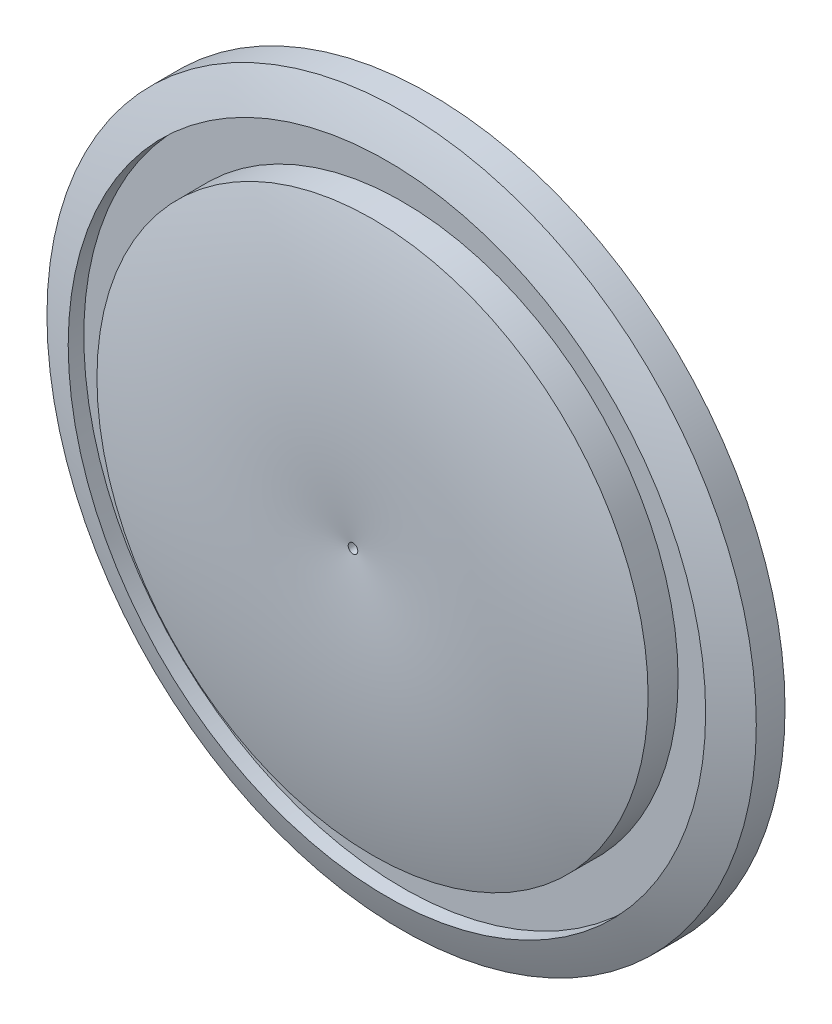
ISO-10303-21;
HEADER;
FILE_DESCRIPTION(('STEP AP214'),'2;1');
FILE_NAME('part.step','',(''),(''),'','','');
FILE_SCHEMA(('AUTOMOTIVE_DESIGN { 1 0 10303 214 1 1 1 1 }'));
ENDSEC;
DATA;
#1=APPLICATION_CONTEXT('core data for automotive mechanical design processes');
#2=APPLICATION_PROTOCOL_DEFINITION('international standard','automotive_design',2000,#1);
#3=PRODUCT_CONTEXT('',#1,'mechanical');
#4=PRODUCT('Part','Part','',(#3));
#5=PRODUCT_RELATED_PRODUCT_CATEGORY('part','',(#4));
#6=PRODUCT_DEFINITION_FORMATION('','',#4);
#7=PRODUCT_DEFINITION_CONTEXT('part definition',#1,'design');
#8=PRODUCT_DEFINITION('design','',#6,#7);
#9=PRODUCT_DEFINITION_SHAPE('','',#8);
#10=(LENGTH_UNIT() NAMED_UNIT(*) SI_UNIT(.MILLI.,.METRE.));
#11=(NAMED_UNIT(*) PLANE_ANGLE_UNIT() SI_UNIT($,.RADIAN.));
#12=(NAMED_UNIT(*) SI_UNIT($,.STERADIAN.) SOLID_ANGLE_UNIT());
#13=UNCERTAINTY_MEASURE_WITH_UNIT(LENGTH_MEASURE(1.E-05),#10,'distance_accuracy_value','');
#14=(GEOMETRIC_REPRESENTATION_CONTEXT(3) GLOBAL_UNCERTAINTY_ASSIGNED_CONTEXT((#13)) GLOBAL_UNIT_ASSIGNED_CONTEXT((#10,
#11,#12)) REPRESENTATION_CONTEXT('',''));
#15=CARTESIAN_POINT('',(0.,0.,0.));
#16=DIRECTION('',(0.,0.,1.));
#17=DIRECTION('',(1.,0.,0.));
#18=AXIS2_PLACEMENT_3D('',#15,#16,#17);
#19=CARTESIAN_POINT('',(0.,0.,-60.236368945266));
#20=DIRECTION('',(0.,0.,-1.));
#21=DIRECTION('',(-1.,0.,0.));
#22=AXIS2_PLACEMENT_3D('',#19,#20,#21);
#23=DEGENERATE_TOROIDAL_SURFACE('',#22,9.94196390232948,66.5759820648709,.T.);
#24=CARTESIAN_POINT('',(0.,0.,5.66667123930457));
#25=DIRECTION('',(0.,0.,-1.));
#26=DIRECTION('',(-1.,0.,0.));
#27=AXIS2_PLACEMENT_3D('',#24,#25,#26);
#28=CIRCLE('',#27,0.5);
#29=CARTESIAN_POINT('',(-0.5,0.,5.66667123930457));
#30=VERTEX_POINT('',#29);
#31=EDGE_CURVE('E44',#30,#30,#28,.F.);
#32=ORIENTED_EDGE('',*,*,#31,.F.);
#33=EDGE_LOOP('',(#32));
#34=FACE_BOUND('',#33,.T.);
#35=CARTESIAN_POINT('',(0.,0.,3.62769893371223));
#36=DIRECTION('',(0.,0.,-1.));
#37=DIRECTION('',(-1.,0.,0.));
#38=AXIS2_PLACEMENT_3D('',#35,#36,#37);
#39=CIRCLE('',#38,28.75);
#40=CARTESIAN_POINT('',(-28.75,0.,3.62769893371223));
#41=VERTEX_POINT('',#40);
#42=EDGE_CURVE('E50',#41,#41,#39,.F.);
#43=ORIENTED_EDGE('',*,*,#42,.T.);
#44=EDGE_LOOP('',(#43));
#45=FACE_BOUND('',#44,.T.);
#46=ADVANCED_FACE('F31',(#34,#45),#23,.T.);
#47=CARTESIAN_POINT('',(0.,0.,-2.40690182250407));
#48=DIRECTION('',(0.,0.,-1.));
#49=DIRECTION('',(-1.,0.,0.));
#50=AXIS2_PLACEMENT_3D('',#47,#48,#49);
#51=PLANE('',#50);
#52=CARTESIAN_POINT('',(0.,0.,-2.40690182250407));
#53=DIRECTION('',(0.,0.,-1.));
#54=DIRECTION('',(-1.,0.,0.));
#55=AXIS2_PLACEMENT_3D('',#52,#53,#54);
#56=CIRCLE('',#55,0.5);
#57=CARTESIAN_POINT('',(-0.5,0.,-2.40690182250407));
#58=VERTEX_POINT('',#57);
#59=EDGE_CURVE('E49',#58,#58,#56,.T.);
#60=ORIENTED_EDGE('',*,*,#59,.F.);
#61=EDGE_LOOP('',(#60));
#62=FACE_BOUND('',#61,.T.);
#63=CARTESIAN_POINT('',(0.,0.,-2.40690182250406));
#64=DIRECTION('',(0.,0.,-1.));
#65=DIRECTION('',(-1.,0.,0.));
#66=AXIS2_PLACEMENT_3D('',#63,#64,#65);
#67=CIRCLE('',#66,37.);
#68=CARTESIAN_POINT('',(-37.,0.,-2.40690182250406));
#69=VERTEX_POINT('',#68);
#70=EDGE_CURVE('E10',#69,#69,#67,.T.);
#71=ORIENTED_EDGE('',*,*,#70,.T.);
#72=EDGE_LOOP('',(#71));
#73=FACE_BOUND('',#72,.T.);
#74=ADVANCED_FACE('F33',(#62,#73),#51,.T.);
#75=CARTESIAN_POINT('',(0.,0.,-18.524642857156));
#76=DIRECTION('',(0.,0.,-1.));
#77=DIRECTION('',(-1.,0.,0.));
#78=AXIS2_PLACEMENT_3D('',#75,#76,#77);
#79=CYLINDRICAL_SURFACE('',#78,37.);
#80=CARTESIAN_POINT('',(0.,0.,0.593098177495935));
#81=DIRECTION('',(0.,0.,-1.));
#82=DIRECTION('',(-1.,0.,0.));
#83=AXIS2_PLACEMENT_3D('',#80,#81,#82);
#84=CIRCLE('',#83,37.);
#85=CARTESIAN_POINT('',(-37.,0.,0.593098177495935));
#86=VERTEX_POINT('',#85);
#87=EDGE_CURVE('E39',#86,#86,#84,.T.);
#88=ORIENTED_EDGE('',*,*,#87,.T.);
#89=EDGE_LOOP('',(#88));
#90=FACE_BOUND('',#89,.T.);
#91=ORIENTED_EDGE('',*,*,#70,.F.);
#92=EDGE_LOOP('',(#91));
#93=FACE_BOUND('',#92,.T.);
#94=ADVANCED_FACE('F69',(#90,#93),#79,.T.);
#95=CARTESIAN_POINT('',(0.,0.,2.12625480623842));
#96=DIRECTION('',(0.,0.,-1.));
#97=DIRECTION('',(-1.,0.,0.));
#98=AXIS2_PLACEMENT_3D('',#95,#96,#97);
#99=CIRCLE('',#98,33.25);
#100=CARTESIAN_POINT('',(-33.25,0.,2.12625480623842));
#101=VERTEX_POINT('',#100);
#102=EDGE_CURVE('E35',#101,#101,#99,.F.);
#103=ORIENTED_EDGE('',*,*,#102,.F.);
#104=EDGE_LOOP('',(#103));
#105=FACE_BOUND('',#104,.T.);
#106=ORIENTED_EDGE('',*,*,#87,.F.);
#107=EDGE_LOOP('',(#106));
#108=FACE_BOUND('',#107,.T.);
#109=ADVANCED_FACE('F74',(#105,#108),#23,.T.);
#110=CARTESIAN_POINT('',(0.,0.,6.33961311960493));
#111=DIRECTION('',(0.,0.,-1.));
#112=DIRECTION('',(-1.,0.,0.));
#113=AXIS2_PLACEMENT_3D('',#110,#111,#112);
#114=CYLINDRICAL_SURFACE('',#113,0.5);
#115=ORIENTED_EDGE('',*,*,#31,.T.);
#116=EDGE_LOOP('',(#115));
#117=FACE_BOUND('',#116,.T.);
#118=ORIENTED_EDGE('',*,*,#59,.T.);
#119=EDGE_LOOP('',(#118));
#120=FACE_BOUND('',#119,.T.);
#121=ADVANCED_FACE('F66',(#117,#120),#114,.F.);
#122=CARTESIAN_POINT('',(0.,0.,0.5));
#123=DIRECTION('',(0.,0.,1.));
#124=DIRECTION('',(1.,0.,0.));
#125=AXIS2_PLACEMENT_3D('',#122,#123,#124);
#126=CYLINDRICAL_SURFACE('',#125,33.25);
#127=ORIENTED_EDGE('',*,*,#102,.T.);
#128=EDGE_LOOP('',(#127));
#129=FACE_BOUND('',#128,.T.);
#130=CARTESIAN_POINT('',(0.,0.,0.5));
#131=DIRECTION('',(0.,0.,1.));
#132=DIRECTION('',(1.,0.,0.));
#133=AXIS2_PLACEMENT_3D('',#130,#131,#132);
#134=CIRCLE('',#133,33.25);
#135=CARTESIAN_POINT('',(33.25,0.,0.5));
#136=VERTEX_POINT('',#135);
#137=EDGE_CURVE('E52',#136,#136,#134,.T.);
#138=ORIENTED_EDGE('',*,*,#137,.F.);
#139=EDGE_LOOP('',(#138));
#140=FACE_BOUND('',#139,.T.);
#141=ADVANCED_FACE('F87',(#129,#140),#126,.F.);
#142=CARTESIAN_POINT('',(0.,0.,0.5));
#143=DIRECTION('',(0.,0.,1.));
#144=DIRECTION('',(1.,0.,0.));
#145=AXIS2_PLACEMENT_3D('',#142,#143,#144);
#146=PLANE('',#145);
#147=CARTESIAN_POINT('',(0.,0.,0.5));
#148=DIRECTION('',(0.,0.,1.));
#149=DIRECTION('',(1.,0.,0.));
#150=AXIS2_PLACEMENT_3D('',#147,#148,#149);
#151=CIRCLE('',#150,28.75);
#152=CARTESIAN_POINT('',(28.75,0.,0.5));
#153=VERTEX_POINT('',#152);
#154=EDGE_CURVE('E57',#153,#153,#151,.T.);
#155=ORIENTED_EDGE('',*,*,#154,.F.);
#156=EDGE_LOOP('',(#155));
#157=FACE_BOUND('',#156,.T.);
#158=ORIENTED_EDGE('',*,*,#137,.T.);
#159=EDGE_LOOP('',(#158));
#160=FACE_BOUND('',#159,.T.);
#161=ADVANCED_FACE('F96',(#157,#160),#146,.T.);
#162=CARTESIAN_POINT('',(0.,0.,0.5));
#163=DIRECTION('',(0.,0.,1.));
#164=DIRECTION('',(1.,0.,0.));
#165=AXIS2_PLACEMENT_3D('',#162,#163,#164);
#166=CYLINDRICAL_SURFACE('',#165,28.75);
#167=ORIENTED_EDGE('',*,*,#42,.F.);
#168=EDGE_LOOP('',(#167));
#169=FACE_BOUND('',#168,.T.);
#170=ORIENTED_EDGE('',*,*,#154,.T.);
#171=EDGE_LOOP('',(#170));
#172=FACE_BOUND('',#171,.T.);
#173=ADVANCED_FACE('F101',(#169,#172),#166,.T.);
#174=CLOSED_SHELL('',(#46,#74,#94,#109,#121,#141,#161,#173));
#175=MANIFOLD_SOLID_BREP('B2',#174);
#176=ADVANCED_BREP_SHAPE_REPRESENTATION('',(#18,#175),#14);
#177=SHAPE_DEFINITION_REPRESENTATION(#9,#176);
ENDSEC;
END-ISO-10303-21;
